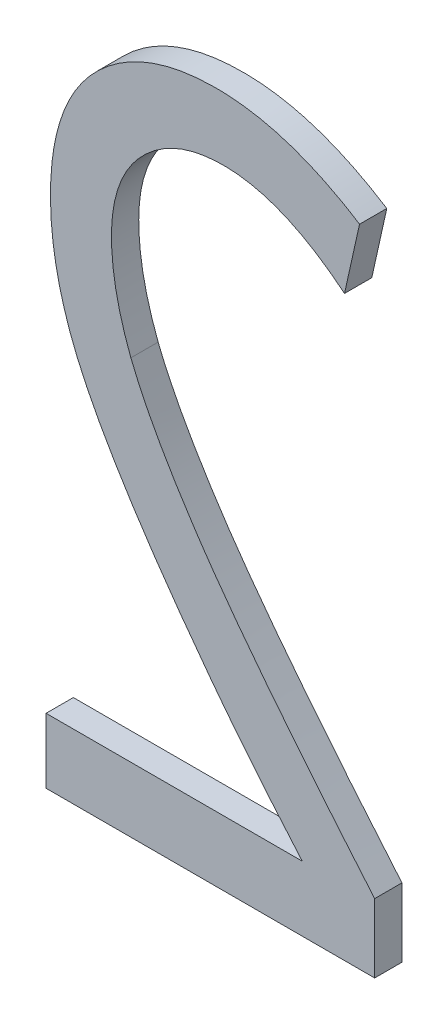
ISO-10303-21;
HEADER;
FILE_DESCRIPTION(('STEP AP214'),'2;1');
FILE_NAME('part.step','',(''),(''),'','','');
FILE_SCHEMA(('AUTOMOTIVE_DESIGN { 1 0 10303 214 1 1 1 1 }'));
ENDSEC;
DATA;
#1=APPLICATION_CONTEXT('core data for automotive mechanical design processes');
#2=APPLICATION_PROTOCOL_DEFINITION('international standard','automotive_design',2000,#1);
#3=PRODUCT_CONTEXT('',#1,'mechanical');
#4=PRODUCT('Part','Part','',(#3));
#5=PRODUCT_RELATED_PRODUCT_CATEGORY('part','',(#4));
#6=PRODUCT_DEFINITION_FORMATION('','',#4);
#7=PRODUCT_DEFINITION_CONTEXT('part definition',#1,'design');
#8=PRODUCT_DEFINITION('design','',#6,#7);
#9=PRODUCT_DEFINITION_SHAPE('','',#8);
#10=(LENGTH_UNIT() NAMED_UNIT(*) SI_UNIT(.MILLI.,.METRE.));
#11=(NAMED_UNIT(*) PLANE_ANGLE_UNIT() SI_UNIT($,.RADIAN.));
#12=(NAMED_UNIT(*) SI_UNIT($,.STERADIAN.) SOLID_ANGLE_UNIT());
#13=UNCERTAINTY_MEASURE_WITH_UNIT(LENGTH_MEASURE(1.E-05),#10,'distance_accuracy_value','');
#14=(GEOMETRIC_REPRESENTATION_CONTEXT(3) GLOBAL_UNCERTAINTY_ASSIGNED_CONTEXT((#13)) GLOBAL_UNIT_ASSIGNED_CONTEXT((#10,
#11,#12)) REPRESENTATION_CONTEXT('',''));
#15=CARTESIAN_POINT('',(0.,0.,0.));
#16=DIRECTION('',(0.,0.,1.));
#17=DIRECTION('',(1.,0.,0.));
#18=AXIS2_PLACEMENT_3D('',#15,#16,#17);
#19=CARTESIAN_POINT('',(176.186462183078,125.948278329335,-39.));
#20=DIRECTION('',(0.,0.,1.));
#21=DIRECTION('',(1.,0.,0.));
#22=AXIS2_PLACEMENT_3D('',#19,#20,#21);
#23=PLANE('',#22);
#24=DIRECTION('',(1.,0.,0.));
#25=VECTOR('',#24,1.);
#26=CARTESIAN_POINT('',(176.186462183078,125.152214694954,-39.));
#27=LINE('',#26,#25);
#28=CARTESIAN_POINT('',(176.538703030518,125.152214694954,-39.));
#29=VERTEX_POINT('',#28);
#30=CARTESIAN_POINT('',(175.599159928158,125.152214694954,-39.));
#31=VERTEX_POINT('',#30);
#32=EDGE_CURVE('E128',#29,#31,#27,.F.);
#33=ORIENTED_EDGE('',*,*,#32,.T.);
#34=DIRECTION('',(0.,1.,0.));
#35=VECTOR('',#34,1.);
#36=CARTESIAN_POINT('',(175.599159928158,125.948278329335,-39.));
#37=LINE('',#36,#35);
#38=CARTESIAN_POINT('',(175.599159928158,124.913993413852,-39.));
#39=VERTEX_POINT('',#38);
#40=EDGE_CURVE('E108',#31,#39,#37,.F.);
#41=ORIENTED_EDGE('',*,*,#40,.T.);
#42=DIRECTION('',(1.,0.,0.));
#43=VECTOR('',#42,1.);
#44=CARTESIAN_POINT('',(176.186462183078,124.913993413852,-39.));
#45=LINE('',#44,#43);
#46=CARTESIAN_POINT('',(176.80425900679,124.913993413852,-39.));
#47=VERTEX_POINT('',#46);
#48=EDGE_CURVE('E104',#39,#47,#45,.T.);
#49=ORIENTED_EDGE('',*,*,#48,.T.);
#50=DIRECTION('',(0.,1.,0.));
#51=VECTOR('',#50,1.);
#52=CARTESIAN_POINT('',(176.80425900679,124.913993413852,-39.));
#53=LINE('',#52,#51);
#54=CARTESIAN_POINT('',(176.80425900679,125.166110936351,-39.));
#55=VERTEX_POINT('',#54);
#56=EDGE_CURVE('E102',#55,#47,#53,.F.);
#57=ORIENTED_EDGE('',*,*,#56,.F.);
#58=CARTESIAN_POINT('',(175.910153238773,126.436624435557,-39.));
#59=CARTESIAN_POINT('',(175.916314288537,126.421132313016,-39.));
#60=CARTESIAN_POINT('',(175.922773583856,126.405762428981,-39.));
#61=CARTESIAN_POINT('',(175.936201752756,126.375247302634,-39.));
#62=CARTESIAN_POINT('',(175.943170600172,126.360102048836,-39.));
#63=CARTESIAN_POINT('',(175.957531371676,126.3300152623,-39.));
#64=CARTESIAN_POINT('',(175.964923281686,126.315073722804,-39.));
#65=CARTESIAN_POINT('',(175.980069878448,126.285376729993,-39.));
#66=CARTESIAN_POINT('',(175.987824557065,126.270621272514,-39.));
#67=CARTESIAN_POINT('',(176.01155977025,126.226603293513,-39.));
#68=CARTESIAN_POINT('',(176.028009625772,126.197592989437,-39.));
#69=CARTESIAN_POINT('',(176.05340589262,126.154512475279,-39.));
#70=CARTESIAN_POINT('',(176.061990835528,126.140225937032,-39.));
#71=CARTESIAN_POINT('',(176.088073130404,126.097562698147,-39.));
#72=CARTESIAN_POINT('',(176.105896806171,126.069384376933,-39.));
#73=CARTESIAN_POINT('',(176.133151976455,126.027460170251,-39.));
#74=CARTESIAN_POINT('',(176.142323247732,126.013543222797,-39.));
#75=CARTESIAN_POINT('',(176.170095567593,125.971961757683,-39.));
#76=CARTESIAN_POINT('',(176.188954099897,125.944468232993,-39.));
#77=CARTESIAN_POINT('',(176.227305520416,125.889930433792,-39.));
#78=CARTESIAN_POINT('',(176.246798392881,125.862886148153,-39.));
#79=CARTESIAN_POINT('',(176.286222888752,125.809121395734,-39.));
#80=CARTESIAN_POINT('',(176.306154502844,125.782400922097,-39.));
#81=CARTESIAN_POINT('',(176.346370982392,125.729228009605,-39.));
#82=CARTESIAN_POINT('',(176.366655843966,125.70277556781,-39.));
#83=CARTESIAN_POINT('',(176.407508617747,125.650090768106,-39.));
#84=CARTESIAN_POINT('',(176.428076528186,125.623858408825,-39.));
#85=CARTESIAN_POINT('',(176.469448333987,125.571580851571,-39.));
#86=CARTESIAN_POINT('',(176.490252228451,125.545535652887,-39.));
#87=CARTESIAN_POINT('',(176.552962459234,125.467638921907,-39.));
#88=CARTESIAN_POINT('',(176.595166709886,125.416027066146,-39.));
#89=CARTESIAN_POINT('',(176.6589181631,125.338980235817,-39.));
#90=CARTESIAN_POINT('',(176.680242604162,125.31336004769,-39.));
#91=CARTESIAN_POINT('',(176.735684020125,125.247101268435,-39.));
#92=CARTESIAN_POINT('',(176.769902964442,125.206547984025,-39.));
#93=CARTESIAN_POINT('',(176.80425900679,125.166110936351,-39.));
#94=B_SPLINE_CURVE_WITH_KNOTS('',3,(#58,#59,#60,#61,#62,#63,#64,#65,#66,#67,#68,#69,#70,#71,#72,
#73,#74,#75,#76,#77,#78,#79,#80,#81,#82,#83,#84,#85,#86,#87,#88,#89,#90,#91,#92,#93),
.UNSPECIFIED.,.F.,.F.,(4,2,2,2,2,2,2,2,2,2,2,2,2,2,2,2,2,4),(0.,0.0500087757286879,
0.100014985312796,0.15001953180802,0.200022957623737,0.300042550380288,0.350044224300969,
0.450054488447357,0.500055433134777,0.600063057039021,0.700068199814345,0.800071221646806,
0.900073145683822,1.00007444573211,1.10007536526149,1.30008029152963,1.40008068587397,
1.55926333786802),.UNSPECIFIED.);
#95=CARTESIAN_POINT('',(175.910153238773,126.436624435557,-39.));
#96=VERTEX_POINT('',#95);
#97=EDGE_CURVE('E24',#96,#55,#94,.T.);
#98=ORIENTED_EDGE('',*,*,#97,.F.);
#99=CARTESIAN_POINT('',(176.693694826555,127.032839364091,-39.));
#100=CARTESIAN_POINT('',(176.667890074658,127.053892125233,-39.));
#101=CARTESIAN_POINT('',(176.641204172883,127.074000949937,-39.));
#102=CARTESIAN_POINT('',(176.58565848333,127.111647626545,-39.));
#103=CARTESIAN_POINT('',(176.556777870025,127.129154494778,-39.));
#104=CARTESIAN_POINT('',(176.496846345355,127.16048662411,-39.));
#105=CARTESIAN_POINT('',(176.465785130981,127.17429268314,-39.));
#106=CARTESIAN_POINT('',(176.401919028892,127.196769154013,-39.));
#107=CARTESIAN_POINT('',(176.369122129279,127.205461184089,-39.));
#108=CARTESIAN_POINT('',(176.32244801561,127.213244571093,-39.));
#109=CARTESIAN_POINT('',(176.308986221254,127.214968783175,-39.));
#110=CARTESIAN_POINT('',(176.281963074258,127.217341189161,-39.));
#111=CARTESIAN_POINT('',(176.268401706681,127.217989218195,-39.));
#112=CARTESIAN_POINT('',(176.241262774364,127.218225631912,-39.));
#113=CARTESIAN_POINT('',(176.227685204816,127.217813431986,-39.));
#114=CARTESIAN_POINT('',(176.200610042577,127.215908870563,-39.));
#115=CARTESIAN_POINT('',(176.187112432014,127.214416760413,-39.));
#116=CARTESIAN_POINT('',(176.151818383751,127.208876445988,-39.));
#117=CARTESIAN_POINT('',(176.130166186019,127.203808940999,-39.));
#118=CARTESIAN_POINT('',(176.088058999034,127.190100637508,-39.));
#119=CARTESIAN_POINT('',(176.067601705668,127.181466993905,-39.));
#120=CARTESIAN_POINT('',(176.028495595677,127.160663213691,-39.));
#121=CARTESIAN_POINT('',(176.009850910823,127.148485238908,-39.));
#122=CARTESIAN_POINT('',(175.983670521943,127.127964627676,-39.));
#123=CARTESIAN_POINT('',(175.975231364355,127.120737580784,-39.));
#124=CARTESIAN_POINT('',(175.95894869125,127.105636316063,-39.));
#125=CARTESIAN_POINT('',(175.951105224365,127.097762045503,-39.));
#126=CARTESIAN_POINT('',(175.936120078777,127.081401713745,-39.));
#127=CARTESIAN_POINT('',(175.928976823645,127.072917105028,-39.));
#128=CARTESIAN_POINT('',(175.915500689425,127.055332912897,-39.));
#129=CARTESIAN_POINT('',(175.909167560505,127.046233520403,-39.));
#130=CARTESIAN_POINT('',(175.89147098491,127.018179588419,-39.));
#131=CARTESIAN_POINT('',(175.881362082298,126.998416641936,-39.));
#132=CARTESIAN_POINT('',(175.863262418195,126.954227978386,-39.));
#133=CARTESIAN_POINT('',(175.85587014431,126.929562397221,-39.));
#134=CARTESIAN_POINT('',(175.845151021304,126.879305951645,-39.));
#135=CARTESIAN_POINT('',(175.841840710998,126.853711752755,-39.));
#136=CARTESIAN_POINT('',(175.838854039364,126.806551172577,-39.));
#137=CARTESIAN_POINT('',(175.838672351285,126.785009869475,-39.));
#138=CARTESIAN_POINT('',(175.840035148776,126.741972564923,-39.));
#139=CARTESIAN_POINT('',(175.841581044824,126.720476614867,-39.));
#140=CARTESIAN_POINT('',(175.846287160083,126.677627307793,-39.));
#141=CARTESIAN_POINT('',(175.849450101943,126.656274252999,-39.));
#142=CARTESIAN_POINT('',(175.857218525628,126.613847555168,-39.));
#143=CARTESIAN_POINT('',(175.861823261039,126.592773773423,-39.));
#144=CARTESIAN_POINT('',(175.872850443304,126.548827276364,-39.));
#145=CARTESIAN_POINT('',(175.879410031041,126.525989308048,-39.));
#146=CARTESIAN_POINT('',(175.893844505575,126.480899623099,-39.));
#147=CARTESIAN_POINT('',(175.901710294248,126.458645005543,-39.));
#148=CARTESIAN_POINT('',(175.910153238773,126.436624435557,-39.));
#149=B_SPLINE_CURVE_WITH_KNOTS('',3,(#99,#100,#101,#102,#103,#104,#105,#106,#107,#108,#109,#110,
#111,#112,#113,#114,#115,#116,#117,#118,#119,#120,#121,#122,#123,#124,#125,#126,#127,#128,#129,
#130,#131,#132,#133,#134,#135,#136,#137,#138,#139,#140,#141,#142,#143,#144,#145,#146,#147,#148),
.UNSPECIFIED.,.F.,.F.,(4,2,2,2,2,2,2,2,2,2,2,2,2,2,2,2,2,2,2,2,2,2,2,2,4),(0.,0.100017091060518,
0.201143319787843,0.302784519930571,0.403992912424018,0.444673257895493,0.485359834993983,
0.526068851491846,0.566768396115531,0.633179965507584,0.699458932731975,0.76588560212782,
0.799188569711173,0.832494253265738,0.865723143215218,0.898941760980865,0.965167907700336,
1.04200009692954,1.11914257357634,1.1836822873529,1.24827473282225,1.31297629365965,
1.37764441378402,1.44888237926519,1.51964349919607),.UNSPECIFIED.);
#150=CARTESIAN_POINT('',(176.693694826555,127.032839364091,-39.));
#151=VERTEX_POINT('',#150);
#152=EDGE_CURVE('E89',#151,#96,#149,.T.);
#153=ORIENTED_EDGE('',*,*,#152,.F.);
#154=DIRECTION('',(0.217054100601057,0.976159575792947,0.));
#155=VECTOR('',#154,1.);
#156=CARTESIAN_POINT('',(176.693694826555,127.032839364091,-39.));
#157=LINE('',#156,#155);
#158=CARTESIAN_POINT('',(176.748724487038,127.280324806124,-39.));
#159=VERTEX_POINT('',#158);
#160=EDGE_CURVE('E125',#159,#151,#157,.F.);
#161=ORIENTED_EDGE('',*,*,#160,.F.);
#162=CARTESIAN_POINT('',(176.538703030518,125.152214694954,-39.));
#163=CARTESIAN_POINT('',(176.516823193256,125.177352437158,-39.));
#164=CARTESIAN_POINT('',(176.495069673509,125.202599393354,-39.));
#165=CARTESIAN_POINT('',(176.451828996767,125.253346808572,-39.));
#166=CARTESIAN_POINT('',(176.430342009775,125.278847412402,-39.));
#167=CARTESIAN_POINT('',(176.366257334359,125.355837055005,-39.));
#168=CARTESIAN_POINT('',(176.324122205599,125.407715208436,-39.));
#169=CARTESIAN_POINT('',(176.24153286093,125.512802634338,-39.));
#170=CARTESIAN_POINT('',(176.20107890225,125.566012108527,-39.));
#171=CARTESIAN_POINT('',(176.121391786666,125.673272051005,-39.));
#172=CARTESIAN_POINT('',(176.08215773043,125.727321853466,-39.));
#173=CARTESIAN_POINT('',(176.005357188513,125.836590482849,-39.));
#174=CARTESIAN_POINT('',(175.967790418349,125.891809107946,-39.));
#175=CARTESIAN_POINT('',(175.905438250807,125.987709087949,-39.));
#176=CARTESIAN_POINT('',(175.880078736669,126.02801472736,-39.));
#177=CARTESIAN_POINT('',(175.843251929329,126.089258759104,-39.));
#178=CARTESIAN_POINT('',(175.831166839112,126.109825488198,-39.));
#179=CARTESIAN_POINT('',(175.807491903833,126.151254066613,-39.));
#180=CARTESIAN_POINT('',(175.795902254936,126.172116028556,-39.));
#181=CARTESIAN_POINT('',(175.774290417139,126.212411939061,-39.));
#182=CARTESIAN_POINT('',(175.764218268992,126.2318190186,-39.));
#183=CARTESIAN_POINT('',(175.744712567438,126.270952836367,-39.));
#184=CARTESIAN_POINT('',(175.735278987782,126.290679561413,-39.));
#185=CARTESIAN_POINT('',(175.717289980596,126.330528332224,-39.));
#186=CARTESIAN_POINT('',(175.708734358951,126.350650289425,-39.));
#187=CARTESIAN_POINT('',(175.692639876808,126.391295204578,-39.));
#188=CARTESIAN_POINT('',(175.685101021988,126.411818164769,-39.));
#189=CARTESIAN_POINT('',(175.664129463157,126.473796303652,-39.));
#190=CARTESIAN_POINT('',(175.652276865338,126.515802675121,-39.));
#191=CARTESIAN_POINT('',(175.633305636271,126.600863530483,-39.));
#192=CARTESIAN_POINT('',(175.626185521249,126.643917681475,-39.));
#193=CARTESIAN_POINT('',(175.616662444173,126.733481552713,-39.));
#194=CARTESIAN_POINT('',(175.614610223788,126.78002840288,-39.));
#195=CARTESIAN_POINT('',(175.616429839409,126.87310226004,-39.));
#196=CARTESIAN_POINT('',(175.620304804156,126.919629243576,-39.));
#197=CARTESIAN_POINT('',(175.634028364101,126.99909519334,-39.));
#198=CARTESIAN_POINT('',(175.642002734946,127.032341061517,-39.));
#199=CARTESIAN_POINT('',(175.663120550097,127.097086364679,-39.));
#200=CARTESIAN_POINT('',(175.676247146821,127.128591113819,-39.));
#201=CARTESIAN_POINT('',(175.708375172988,127.188983979122,-39.));
#202=CARTESIAN_POINT('',(175.727439941304,127.217839319992,-39.));
#203=CARTESIAN_POINT('',(175.760086120777,127.25779232083,-39.));
#204=CARTESIAN_POINT('',(175.771661424293,127.270570001373,-39.));
#205=CARTESIAN_POINT('',(175.796026049451,127.294911409495,-39.));
#206=CARTESIAN_POINT('',(175.80881560341,127.306474903873,-39.));
#207=CARTESIAN_POINT('',(175.844898234257,127.336203641336,-39.));
#208=CARTESIAN_POINT('',(175.869176379354,127.353194685371,-39.));
#209=CARTESIAN_POINT('',(175.920171582803,127.382992521342,-39.));
#210=CARTESIAN_POINT('',(175.946888065679,127.39580029733,-39.));
#211=CARTESIAN_POINT('',(175.988856200814,127.412072707861,-39.));
#212=CARTESIAN_POINT('',(176.00353080592,127.417086607055,-39.));
#213=CARTESIAN_POINT('',(176.033211114956,127.425971632875,-39.));
#214=CARTESIAN_POINT('',(176.048216540955,127.429843682218,-39.));
#215=CARTESIAN_POINT('',(176.078484902017,127.436506777138,-39.));
#216=CARTESIAN_POINT('',(176.093748168334,127.439296300942,-39.));
#217=CARTESIAN_POINT('',(176.124430980495,127.443853768477,-39.));
#218=CARTESIAN_POINT('',(176.139850596504,127.445621230833,-39.));
#219=CARTESIAN_POINT('',(176.178201836755,127.448853705655,-39.));
#220=CARTESIAN_POINT('',(176.201181214174,127.449764858281,-39.));
#221=CARTESIAN_POINT('',(176.2471329331,127.449688055442,-39.));
#222=CARTESIAN_POINT('',(176.270105273568,127.448699893226,-39.));
#223=CARTESIAN_POINT('',(176.338886742421,127.442778122788,-39.));
#224=CARTESIAN_POINT('',(176.384463729371,127.434879051073,-39.));
#225=CARTESIAN_POINT('',(176.486164074012,127.409022693598,-39.));
#226=CARTESIAN_POINT('',(176.541723376264,127.388889899009,-39.));
#227=CARTESIAN_POINT('',(176.621838010731,127.352364040463,-39.));
#228=CARTESIAN_POINT('',(176.647944881086,127.339174678222,-39.));
#229=CARTESIAN_POINT('',(176.699101969402,127.311014787855,-39.));
#230=CARTESIAN_POINT('',(176.724154565099,127.296048594945,-39.));
#231=CARTESIAN_POINT('',(176.748724487038,127.280324806124,-39.));
#232=B_SPLINE_CURVE_WITH_KNOTS('',3,(#162,#163,#164,#165,#166,#167,#168,#169,#170,#171,#172,
#173,#174,#175,#176,#177,#178,#179,#180,#181,#182,#183,#184,#185,#186,#187,#188,#189,#190,#191,
#192,#193,#194,#195,#196,#197,#198,#199,#200,#201,#202,#203,#204,#205,#206,#207,#208,#209,#210,
#211,#212,#213,#214,#215,#216,#217,#218,#219,#220,#221,#222,#223,#224,#225,#226,#227,#228,#229,
#230,#231),.UNSPECIFIED.,.F.,.F.,(4,2,2,2,2,2,2,2,2,2,2,2,2,2,2,2,2,2,2,2,2,2,2,2,2,2,2,2,2,2,2,
2,2,2,4),(0.,0.0999767718294488,0.20001433383295,0.40048269436516,0.60098161567559,
0.801329041651492,1.00164215072502,1.14446996126355,1.21602823502691,1.28761458405401,
1.35320079741021,1.41878431310205,1.48435329691085,1.54992264675593,1.68059526903046,
1.81122690217317,1.95067370479258,2.09019414161789,2.19241019688083,2.29429475748318,
2.3973055942525,2.44895088202824,2.50060607088349,2.58910563433466,2.677584364564,
2.72406792285437,2.77051381463337,2.81702476375599,2.86355760104066,2.93246017383151,
3.00137024746933,3.1394772454936,3.31572993405236,3.40342355584584,3.49090745239207),.UNSPECIFIED.);
#233=EDGE_CURVE('E173',#29,#159,#232,.T.);
#234=ORIENTED_EDGE('',*,*,#233,.F.);
#235=EDGE_LOOP('',(#33,#41,#49,#57,#98,#153,#161,#234));
#236=FACE_BOUND('',#235,.T.);
#237=ADVANCED_FACE('F17',(#236),#23,.T.);
#238=CARTESIAN_POINT('',(176.80425900679,124.913993413852,-39.1));
#239=DIRECTION('',(1.,0.,0.));
#240=DIRECTION('',(0.,0.,-1.));
#241=AXIS2_PLACEMENT_3D('',#238,#239,#240);
#242=PLANE('',#241);
#243=DIRECTION('',(0.,1.,0.));
#244=VECTOR('',#243,1.);
#245=CARTESIAN_POINT('',(176.80425900679,125.948278329335,-39.1));
#246=LINE('',#245,#244);
#247=CARTESIAN_POINT('',(176.80425900679,124.913993413852,-39.1));
#248=VERTEX_POINT('',#247);
#249=CARTESIAN_POINT('',(176.80425900679,125.166110936351,-39.1));
#250=VERTEX_POINT('',#249);
#251=EDGE_CURVE('E112',#248,#250,#246,.T.);
#252=ORIENTED_EDGE('',*,*,#251,.T.);
#253=DIRECTION('',(0.,0.,-1.));
#254=VECTOR('',#253,1.);
#255=CARTESIAN_POINT('',(176.80425900679,125.166110936351,-39.05));
#256=LINE('',#255,#254);
#257=EDGE_CURVE('E98',#55,#250,#256,.T.);
#258=ORIENTED_EDGE('',*,*,#257,.F.);
#259=ORIENTED_EDGE('',*,*,#56,.T.);
#260=DIRECTION('',(0.,0.,-1.));
#261=VECTOR('',#260,1.);
#262=CARTESIAN_POINT('',(176.80425900679,124.913993413852,-39.1));
#263=LINE('',#262,#261);
#264=EDGE_CURVE('E117',#248,#47,#263,.F.);
#265=ORIENTED_EDGE('',*,*,#264,.F.);
#266=EDGE_LOOP('',(#252,#258,#259,#265));
#267=FACE_BOUND('',#266,.T.);
#268=ADVANCED_FACE('F111',(#267),#242,.T.);
#269=CARTESIAN_POINT('',(176.80425900679,125.166110936351,-39.1));
#270=CARTESIAN_POINT('',(176.80425900679,125.166110936351,-39.));
#271=CARTESIAN_POINT('',(176.512450348454,125.509546616605,-39.1));
#272=CARTESIAN_POINT('',(176.512450348454,125.509546616605,-39.));
#273=CARTESIAN_POINT('',(176.299904595582,125.780192460967,-39.1));
#274=CARTESIAN_POINT('',(176.299904595582,125.780192460967,-39.));
#275=CARTESIAN_POINT('',(176.045510423514,126.15641099938,-39.1));
#276=CARTESIAN_POINT('',(176.045510423514,126.15641099938,-39.));
#277=CARTESIAN_POINT('',(175.960639165821,126.309573085637,-39.1));
#278=CARTESIAN_POINT('',(175.960639165821,126.309573085637,-39.));
#279=CARTESIAN_POINT('',(175.910153238773,126.436624435557,-39.1));
#280=CARTESIAN_POINT('',(175.910153238773,126.436624435557,-39.));
#281=B_SPLINE_SURFACE_WITH_KNOTS('',3,1,((#269,#270),(#271,#272),(#273,#274),(#275,#276),(#277,
#278),(#279,#280)),.UNSPECIFIED.,.F.,.F.,.F.,(4,2,4),(2,2),(0.,0.525907121177191,1.),(1.,1.1),.UNSPECIFIED.);
#282=CARTESIAN_POINT('',(176.80425900679,125.166110936351,-39.1));
#283=CARTESIAN_POINT('',(176.782675981464,125.191513419227,-39.1));
#284=CARTESIAN_POINT('',(176.761147281265,125.216962250277,-39.1));
#285=CARTESIAN_POINT('',(176.718213706342,125.267964156109,-39.1));
#286=CARTESIAN_POINT('',(176.696808831695,125.293517230956,-39.1));
#287=CARTESIAN_POINT('',(176.664805814007,125.331933634558,-39.1));
#288=CARTESIAN_POINT('',(176.654155535516,125.344753553456,-39.1));
#289=CARTESIAN_POINT('',(176.62226016726,125.38325948921,-39.1));
#290=CARTESIAN_POINT('',(176.601070621653,125.408991593318,-39.1));
#291=CARTESIAN_POINT('',(176.56941362243,125.447693752213,-39.1));
#292=CARTESIAN_POINT('',(176.558882525628,125.460611785303,-39.1));
#293=CARTESIAN_POINT('',(176.537866061777,125.486484993364,-39.1));
#294=CARTESIAN_POINT('',(176.527380694738,125.499440168343,-39.1));
#295=CARTESIAN_POINT('',(176.495998182996,125.538365440216,-39.1));
#296=CARTESIAN_POINT('',(176.475174762594,125.564395119262,-39.1));
#297=CARTESIAN_POINT('',(176.444113917551,125.603577551715,-39.1));
#298=CARTESIAN_POINT('',(176.433789377762,125.616661312678,-39.1));
#299=CARTESIAN_POINT('',(176.413203935729,125.64287884194,-39.1));
#300=CARTESIAN_POINT('',(176.402943033516,125.656012610264,-39.1));
#301=CARTESIAN_POINT('',(176.382491203648,125.682334544677,-39.1));
#302=CARTESIAN_POINT('',(176.372300276038,125.695522710801,-39.1));
#303=CARTESIAN_POINT('',(176.351995896369,125.721958591561,-39.1));
#304=CARTESIAN_POINT('',(176.341882444376,125.735206306246,-39.1));
#305=CARTESIAN_POINT('',(176.321741907581,125.761767281336,-39.1));
#306=CARTESIAN_POINT('',(176.311714822875,125.775080541813,-39.1));
#307=CARTESIAN_POINT('',(176.291757806607,125.801779752349,-39.1));
#308=CARTESIAN_POINT('',(176.281827875188,125.815165702517,-39.1));
#309=CARTESIAN_POINT('',(176.262078064756,125.842018656015,-39.1));
#310=CARTESIAN_POINT('',(176.252258185967,125.855485659511,-39.1));
#311=CARTESIAN_POINT('',(176.232745547282,125.882511554603,-39.1));
#312=CARTESIAN_POINT('',(176.223052787753,125.896070446465,-39.1));
#313=CARTESIAN_POINT('',(176.203812104933,125.923290901018,-39.1));
#314=CARTESIAN_POINT('',(176.194264182254,125.936952464142,-39.1));
#315=CARTESIAN_POINT('',(176.175350828046,125.964401450942,-39.1));
#316=CARTESIAN_POINT('',(176.16598539746,125.978188875267,-39.1));
#317=CARTESIAN_POINT('',(176.14741645514,126.005872234078,-39.1));
#318=CARTESIAN_POINT('',(176.138212942725,126.019768168108,-39.1));
#319=CARTESIAN_POINT('',(176.124537038515,126.040696336037,-39.1));
#320=CARTESIAN_POINT('',(176.119999992063,126.047686393177,-39.1));
#321=CARTESIAN_POINT('',(176.106457001408,126.068701001598,-39.1));
#322=CARTESIAN_POINT('',(176.097519367221,126.082769746585,-39.1));
#323=CARTESIAN_POINT('',(176.084264163448,126.103967088467,-39.1));
#324=CARTESIAN_POINT('',(176.079871004481,126.111048516411,-39.1));
#325=CARTESIAN_POINT('',(176.071137898534,126.125244103805,-39.1));
#326=CARTESIAN_POINT('',(176.066797951591,126.132358263278,-39.1));
#327=CARTESIAN_POINT('',(176.053861993642,126.153752216135,-39.1));
#328=CARTESIAN_POINT('',(176.045350096379,126.168083115382,-39.1));
#329=CARTESIAN_POINT('',(176.032771807609,126.1896892849,-39.1));
#330=CARTESIAN_POINT('',(176.028610685044,126.196909559856,-39.1));
#331=CARTESIAN_POINT('',(176.020355593264,126.211388474837,-39.1));
#332=CARTESIAN_POINT('',(176.01626162413,126.218647114908,-39.1));
#333=CARTESIAN_POINT('',(176.008145368728,126.233204308702,-39.1));
#334=CARTESIAN_POINT('',(176.00412308256,126.240502862481,-39.1));
#335=CARTESIAN_POINT('',(175.992170381668,126.262462016431,-39.1));
#336=CARTESIAN_POINT('',(175.984354514512,126.277185427135,-39.1));
#337=CARTESIAN_POINT('',(175.972895755207,126.299406347226,-39.1));
#338=CARTESIAN_POINT('',(175.969120417223,126.306835800485,-39.1));
#339=CARTESIAN_POINT('',(175.961665050022,126.321742488232,-39.1));
#340=CARTESIAN_POINT('',(175.957985021076,126.329219722856,-39.1));
#341=CARTESIAN_POINT('',(175.950728164034,126.34422416894,-39.1));
#342=CARTESIAN_POINT('',(175.947151336296,126.351751380574,-39.1));
#343=CARTESIAN_POINT('',(175.94010993047,126.366858212728,-39.1));
#344=CARTESIAN_POINT('',(175.936645352858,126.37443783347,-39.1));
#345=CARTESIAN_POINT('',(175.929838617987,126.389651983016,-39.1));
#346=CARTESIAN_POINT('',(175.926496461367,126.397286512107,-39.1));
#347=CARTESIAN_POINT('',(175.918733588919,126.415452749111,-39.1));
#348=CARTESIAN_POINT('',(175.914372098692,126.426009763201,-39.1));
#349=CARTESIAN_POINT('',(175.910153238773,126.436624435557,-39.1));
#350=B_SPLINE_CURVE_WITH_KNOTS('',3,(#282,#283,#284,#285,#286,#287,#288,#289,#290,#291,#292,
#293,#294,#295,#296,#297,#298,#299,#300,#301,#302,#303,#304,#305,#306,#307,#308,#309,#310,#311,
#312,#313,#314,#315,#316,#317,#318,#319,#320,#321,#322,#323,#324,#325,#326,#327,#328,#329,#330,
#331,#332,#333,#334,#335,#336,#337,#338,#339,#340,#341,#342,#343,#344,#345,#346,#347,#348,#349),
.UNSPECIFIED.,.F.,.F.,(4,2,2,2,2,2,2,2,2,2,2,2,2,2,2,2,2,2,2,2,2,2,2,2,2,2,2,2,2,2,2,2,2,4),(0.,
0.100000254559602,0.20000057150244,0.250000619652475,0.350001075308052,0.400001146390069,
0.450001228333165,0.550002031145756,0.600002162630437,0.650002319417866,0.700002508458128,
0.750002739259425,0.800003025103918,0.85000338499375,0.90000384687211,0.950004453168657,
1.00000527079363,1.05000634658731,1.10000721193615,1.12500733661947,1.17500846167313,
1.20000862614633,1.22500880769711,1.27501047539738,1.30001072513174,1.32501100520887,
1.35001132079574,1.40001430863975,1.42501477479512,1.45001531215103,1.47501593588351,
1.5000166653469,1.52501752549395,1.55928215406863),.UNSPECIFIED.);
#351=CARTESIAN_POINT('',(175.910153238773,126.436624435557,-39.1));
#352=VERTEX_POINT('',#351);
#353=EDGE_CURVE('E167',#250,#352,#350,.T.);
#354=DIRECTION('',(0.,0.,-1.));
#355=VECTOR('',#354,1.);
#356=CARTESIAN_POINT('',(175.910153238773,126.436624435557,-39.05));
#357=LINE('',#356,#355);
#358=EDGE_CURVE('E100',#96,#352,#357,.T.);
#359=ORIENTED_EDGE('',*,*,#353,.T.);
#360=ORIENTED_EDGE('',*,*,#358,.F.);
#361=ORIENTED_EDGE('',*,*,#97,.T.);
#362=ORIENTED_EDGE('',*,*,#257,.T.);
#363=EDGE_LOOP('',(#359,#360,#361,#362));
#364=FACE_BOUND('',#363,.T.);
#365=ADVANCED_FACE('F96',(#364),#281,.T.);
#366=CARTESIAN_POINT('',(175.910153238773,126.436624435557,-39.1));
#367=CARTESIAN_POINT('',(175.910153238773,126.436624435557,-39.));
#368=CARTESIAN_POINT('',(175.862696467348,126.560367156574,-39.1));
#369=CARTESIAN_POINT('',(175.862696467348,126.560367156574,-39.));
#370=CARTESIAN_POINT('',(175.838968081636,126.677492619782,-39.1));
#371=CARTESIAN_POINT('',(175.838968081636,126.677492619782,-39.));
#372=CARTESIAN_POINT('',(175.838968081636,126.91372872354,-39.1));
#373=CARTESIAN_POINT('',(175.838968081636,126.91372872354,-39.));
#374=CARTESIAN_POINT('',(175.874308230569,127.014972768008,-39.1));
#375=CARTESIAN_POINT('',(175.874308230569,127.014972768008,-39.));
#376=CARTESIAN_POINT('',(176.023465893981,127.175564468112,-39.1));
#377=CARTESIAN_POINT('',(176.023465893981,127.175564468112,-39.));
#378=CARTESIAN_POINT('',(176.125223287997,127.218122582725,-39.1));
#379=CARTESIAN_POINT('',(176.125223287997,127.218122582725,-39.));
#380=CARTESIAN_POINT('',(176.394313279162,127.218122582725,-39.1));
#381=CARTESIAN_POINT('',(176.394313279162,127.218122582725,-39.));
#382=CARTESIAN_POINT('',(176.542237045412,127.156582085107,-39.1));
#383=CARTESIAN_POINT('',(176.542237045412,127.156582085107,-39.));
#384=CARTESIAN_POINT('',(176.693694826555,127.032839364091,-39.1));
#385=CARTESIAN_POINT('',(176.693694826555,127.032839364091,-39.));
#386=B_SPLINE_SURFACE_WITH_KNOTS('',3,1,((#366,#367),(#368,#369),(#370,#371),(#372,#373),(#374,
#375),(#376,#377),(#378,#379),(#380,#381),(#382,#383),(#384,#385)),.UNSPECIFIED.,.F.,.F.,.F.,(4,
2,2,2,4),(2,2),(0.,0.206536823199473,0.44151883761803,0.702422795278672,1.),(1.,1.1),.UNSPECIFIED.);
#387=CARTESIAN_POINT('',(175.910153238773,126.436624435557,-39.1));
#388=CARTESIAN_POINT('',(175.898292950708,126.467591222721,-39.1));
#389=CARTESIAN_POINT('',(175.887554703026,126.499022059179,-39.1));
#390=CARTESIAN_POINT('',(175.868713160722,126.563315623003,-39.1));
#391=CARTESIAN_POINT('',(175.860664724906,126.596194278501,-39.1));
#392=CARTESIAN_POINT('',(175.846049895341,126.673515447798,-39.1));
#393=CARTESIAN_POINT('',(175.840820830945,126.718235286101,-39.1));
#394=CARTESIAN_POINT('',(175.838645300768,126.785328941896,-39.1));
#395=CARTESIAN_POINT('',(175.838854776825,126.807621450309,-39.1));
#396=CARTESIAN_POINT('',(175.841807529596,126.852025149074,-39.1));
#397=CARTESIAN_POINT('',(175.844545945602,126.874136605188,-39.1));
#398=CARTESIAN_POINT('',(175.853066638301,126.917993665187,-39.1));
#399=CARTESIAN_POINT('',(175.858876140384,126.939734171986,-39.1));
#400=CARTESIAN_POINT('',(175.873983218492,126.981970999731,-39.1));
#401=CARTESIAN_POINT('',(175.883274568399,127.002469466093,-39.1));
#402=CARTESIAN_POINT('',(175.899879998627,127.031740122677,-39.1));
#403=CARTESIAN_POINT('',(175.905879992594,127.041274889768,-39.1));
#404=CARTESIAN_POINT('',(175.918731358269,127.059757940471,-39.1));
#405=CARTESIAN_POINT('',(175.92558279208,127.06870618123,-39.1));
#406=CARTESIAN_POINT('',(175.940092325534,127.085949643972,-39.1));
#407=CARTESIAN_POINT('',(175.947752080383,127.094243462767,-39.1));
#408=CARTESIAN_POINT('',(175.963699128826,127.110204842734,-39.1));
#409=CARTESIAN_POINT('',(175.971986528142,127.117872297946,-39.1));
#410=CARTESIAN_POINT('',(175.988853238808,127.132185412859,-39.1));
#411=CARTESIAN_POINT('',(175.997408433875,127.138859317341,-39.1));
#412=CARTESIAN_POINT('',(176.015050383672,127.151452402684,-39.1));
#413=CARTESIAN_POINT('',(176.024136966571,127.157371825569,-39.1));
#414=CARTESIAN_POINT('',(176.052076826852,127.173875472533,-39.1));
#415=CARTESIAN_POINT('',(176.071664054796,127.183251097187,-39.1));
#416=CARTESIAN_POINT('',(176.111778075044,127.198425612609,-39.1));
#417=CARTESIAN_POINT('',(176.132283646548,127.204281757979,-39.1));
#418=CARTESIAN_POINT('',(176.173962604527,127.212877323089,-39.1));
#419=CARTESIAN_POINT('',(176.195137556456,127.215608780202,-39.1));
#420=CARTESIAN_POINT('',(176.2458612912,127.218959946058,-39.1));
#421=CARTESIAN_POINT('',(176.275494924228,127.218361539624,-39.1));
#422=CARTESIAN_POINT('',(176.334189548858,127.212126425146,-39.1));
#423=CARTESIAN_POINT('',(176.363250766945,127.206491752449,-39.1));
#424=CARTESIAN_POINT('',(176.429631953722,127.18835298036,-39.1));
#425=CARTESIAN_POINT('',(176.466489346949,127.174188957104,-39.1));
#426=CARTESIAN_POINT('',(176.537575938848,127.140245987467,-39.1));
#427=CARTESIAN_POINT('',(176.571794983044,127.120446601187,-39.1));
#428=CARTESIAN_POINT('',(176.620124824145,127.088461534642,-39.1));
#429=CARTESIAN_POINT('',(176.63528203931,127.07780126417,-39.1));
#430=CARTESIAN_POINT('',(176.664939892734,127.055807784361,-39.1));
#431=CARTESIAN_POINT('',(176.679444332243,127.04447971211,-39.1));
#432=CARTESIAN_POINT('',(176.693694826555,127.032839364091,-39.1));
#433=B_SPLINE_CURVE_WITH_KNOTS('',3,(#387,#388,#389,#390,#391,#392,#393,#394,#395,#396,#397,
#398,#399,#400,#401,#402,#403,#404,#405,#406,#407,#408,#409,#410,#411,#412,#413,#414,#415,#416,
#417,#418,#419,#420,#421,#422,#423,#424,#425,#426,#427,#428,#429,#430,#431,#432),.UNSPECIFIED.,
.F.,.F.,(4,2,2,2,2,2,2,2,2,2,2,2,2,2,2,2,2,2,2,2,2,2,4),(0.,0.0994993194010327,
0.200919116723412,0.33538410263356,0.402172627954814,0.468833049997089,0.536094583494465,
0.60323641177214,0.636992639629307,0.670751331079967,0.704580543597287,0.738415467131443,
0.770926269763768,0.803426617122732,0.868217703169997,0.931924039780765,0.995792359765241,
1.0842533440518,1.17267859404232,1.29047093347902,1.40869608177994,1.46427050942085,
1.51946240400369),.UNSPECIFIED.);
#434=CARTESIAN_POINT('',(176.693694826555,127.032839364091,-39.1));
#435=VERTEX_POINT('',#434);
#436=EDGE_CURVE('E152',#352,#435,#433,.T.);
#437=DIRECTION('',(0.,0.,1.));
#438=VECTOR('',#437,1.);
#439=CARTESIAN_POINT('',(176.693694826555,127.032839364091,-39.1));
#440=LINE('',#439,#438);
#441=EDGE_CURVE('E127',#151,#435,#440,.F.);
#442=ORIENTED_EDGE('',*,*,#436,.T.);
#443=ORIENTED_EDGE('',*,*,#441,.F.);
#444=ORIENTED_EDGE('',*,*,#152,.T.);
#445=ORIENTED_EDGE('',*,*,#358,.T.);
#446=EDGE_LOOP('',(#442,#443,#444,#445));
#447=FACE_BOUND('',#446,.T.);
#448=ADVANCED_FACE('F182',(#447),#386,.T.);
#449=CARTESIAN_POINT('',(176.693694826555,127.032839364091,-39.1));
#450=DIRECTION('',(0.976159575792947,-0.217054100601057,0.));
#451=DIRECTION('',(0.217054100601057,0.976159575792947,0.));
#452=AXIS2_PLACEMENT_3D('',#449,#450,#451);
#453=PLANE('',#452);
#454=DIRECTION('',(0.217054100600976,0.976159575792965,0.));
#455=VECTOR('',#454,1.);
#456=CARTESIAN_POINT('',(176.693694826555,127.032839364091,-39.1));
#457=LINE('',#456,#455);
#458=CARTESIAN_POINT('',(176.748724487038,127.280324806124,-39.1));
#459=VERTEX_POINT('',#458);
#460=EDGE_CURVE('E151',#435,#459,#457,.T.);
#461=ORIENTED_EDGE('',*,*,#460,.T.);
#462=DIRECTION('',(0.,0.,-1.));
#463=VECTOR('',#462,1.);
#464=CARTESIAN_POINT('',(176.748724487038,127.280324806124,-39.05));
#465=LINE('',#464,#463);
#466=EDGE_CURVE('E227',#159,#459,#465,.T.);
#467=ORIENTED_EDGE('',*,*,#466,.F.);
#468=ORIENTED_EDGE('',*,*,#160,.T.);
#469=ORIENTED_EDGE('',*,*,#441,.T.);
#470=EDGE_LOOP('',(#461,#467,#468,#469));
#471=FACE_BOUND('',#470,.T.);
#472=ADVANCED_FACE('F195',(#471),#453,.T.);
#473=CARTESIAN_POINT('',(176.748724487038,127.280324806124,-39.1));
#474=CARTESIAN_POINT('',(176.748724487038,127.280324806124,-39.));
#475=CARTESIAN_POINT('',(176.573033460911,127.392818188866,-39.1));
#476=CARTESIAN_POINT('',(176.573033460911,127.392818188866,-39.));
#477=CARTESIAN_POINT('',(176.397847294055,127.449726606018,-39.1));
#478=CARTESIAN_POINT('',(176.397847294055,127.449726606018,-39.));
#479=CARTESIAN_POINT('',(176.053533271589,127.449726606018,-39.1));
#480=CARTESIAN_POINT('',(176.053533271589,127.449726606018,-39.));
#481=CARTESIAN_POINT('',(175.913182394396,127.400097172455,-39.1));
#482=CARTESIAN_POINT('',(175.913182394396,127.400097172455,-39.));
#483=CARTESIAN_POINT('',(175.678844992316,127.189197519461,-39.1));
#484=CARTESIAN_POINT('',(175.678844992316,127.189197519461,-39.));
#485=CARTESIAN_POINT('',(175.615315424814,127.02423692894,-39.1));
#486=CARTESIAN_POINT('',(175.615315424814,127.02423692894,-39.));
#487=CARTESIAN_POINT('',(175.615315424814,126.641097701835,-39.1));
#488=CARTESIAN_POINT('',(175.615315424814,126.641097701835,-39.));
#489=CARTESIAN_POINT('',(175.651665292288,126.476989708188,-39.1));
#490=CARTESIAN_POINT('',(175.651665292288,126.476989708188,-39.));
#491=CARTESIAN_POINT('',(175.811038582171,126.121581994284,-39.1));
#492=CARTESIAN_POINT('',(175.811038582171,126.121581994284,-39.));
#493=CARTESIAN_POINT('',(175.976289803206,125.86158473201,-39.1));
#494=CARTESIAN_POINT('',(175.976289803206,125.86158473201,-39.));
#495=CARTESIAN_POINT('',(176.318647886816,125.411935642372,-39.1));
#496=CARTESIAN_POINT('',(176.318647886816,125.411935642372,-39.));
#497=CARTESIAN_POINT('',(176.42409997612,125.28389812534,-39.1));
#498=CARTESIAN_POINT('',(176.42409997612,125.28389812534,-39.));
#499=CARTESIAN_POINT('',(176.538703030518,125.152214694954,-39.1));
#500=CARTESIAN_POINT('',(176.538703030518,125.152214694954,-39.));
#501=B_SPLINE_SURFACE_WITH_KNOTS('',3,1,((#473,#474),(#475,#476),(#477,#478),(#479,#480),(#481,
#482),(#483,#484),(#485,#486),(#487,#488),(#489,#490),(#491,#492),(#493,#494),(#495,#496),(#497,
#498),(#499,#500)),.UNSPECIFIED.,.F.,.F.,.F.,(4,2,2,2,2,2,4),(2,2),(0.,0.188736121441833,
0.373095753111103,0.583082061038919,0.740413192054324,0.927985381092943,1.),(1.,1.1),.UNSPECIFIED.);
#502=CARTESIAN_POINT('',(176.748724487038,127.280324806124,-39.1));
#503=CARTESIAN_POINT('',(176.720613352634,127.298313455144,-39.1));
#504=CARTESIAN_POINT('',(176.69186053202,127.315316644728,-39.1));
#505=CARTESIAN_POINT('',(176.632887463196,127.346994768735,-39.1));
#506=CARTESIAN_POINT('',(176.602659573235,127.361655408597,-39.1));
#507=CARTESIAN_POINT('',(176.522791430325,127.395803785477,-39.1));
#508=CARTESIAN_POINT('',(176.472150996592,127.413089401918,-39.1));
#509=CARTESIAN_POINT('',(176.394549861949,127.431992232939,-39.1));
#510=CARTESIAN_POINT('',(176.368414342404,127.437121947579,-39.1));
#511=CARTESIAN_POINT('',(176.315767382272,127.444869105982,-39.1));
#512=CARTESIAN_POINT('',(176.289256056863,127.447487303279,-39.1));
#513=CARTESIAN_POINT('',(176.243165578059,127.449723079654,-39.1));
#514=CARTESIAN_POINT('',(176.22361325848,127.449952435077,-39.1));
#515=CARTESIAN_POINT('',(176.184537336366,127.449055952829,-39.1));
#516=CARTESIAN_POINT('',(176.165013734822,127.447930069436,-39.1));
#517=CARTESIAN_POINT('',(176.126134605024,127.444155711783,-39.1));
#518=CARTESIAN_POINT('',(176.106778881359,127.441509349524,-39.1));
#519=CARTESIAN_POINT('',(176.068377638149,127.434553002054,-39.1));
#520=CARTESIAN_POINT('',(176.04933202727,127.430243516255,-39.1));
#521=CARTESIAN_POINT('',(176.000010340065,127.41657360744,-39.1));
#522=CARTESIAN_POINT('',(175.970114039861,127.405738690337,-39.1));
#523=CARTESIAN_POINT('',(175.927004290659,127.38580919001,-39.1));
#524=CARTESIAN_POINT('',(175.912917373627,127.378548956475,-39.1));
#525=CARTESIAN_POINT('',(175.885419499406,127.362832374121,-39.1));
#526=CARTESIAN_POINT('',(175.872008613983,127.354375898672,-39.1));
#527=CARTESIAN_POINT('',(175.845938622589,127.336303562234,-39.1));
#528=CARTESIAN_POINT('',(175.83328177442,127.326684457232,-39.1));
#529=CARTESIAN_POINT('',(175.808818350922,127.306419172749,-39.1));
#530=CARTESIAN_POINT('',(175.797011725738,127.295773053576,-39.1));
#531=CARTESIAN_POINT('',(175.774433175238,127.273443498695,-39.1));
#532=CARTESIAN_POINT('',(175.763660589293,127.261760734587,-39.1));
#533=CARTESIAN_POINT('',(175.743249868987,127.237450624275,-39.1));
#534=CARTESIAN_POINT('',(175.733611608019,127.224823383746,-39.1));
#535=CARTESIAN_POINT('',(175.707606799814,127.18727599269,-39.1));
#536=CARTESIAN_POINT('',(175.69275290998,127.161287225983,-39.1));
#537=CARTESIAN_POINT('',(175.667345258584,127.107315297824,-39.1));
#538=CARTESIAN_POINT('',(175.656795501618,127.079330307377,-39.1));
#539=CARTESIAN_POINT('',(175.635234720046,127.007779235638,-39.1));
#540=CARTESIAN_POINT('',(175.626676426936,126.963475631324,-39.1));
#541=CARTESIAN_POINT('',(175.618977413958,126.896486105556,-39.1));
#542=CARTESIAN_POINT('',(175.617269501598,126.874015319655,-39.1));
#543=CARTESIAN_POINT('',(175.615321279072,126.829003372612,-39.1));
#544=CARTESIAN_POINT('',(175.615080998963,126.806462210039,-39.1));
#545=CARTESIAN_POINT('',(175.616147575815,126.751604179766,-39.1));
#546=CARTESIAN_POINT('',(175.618172898591,126.719300199258,-39.1));
#547=CARTESIAN_POINT('',(175.625006308446,126.6549836595,-39.1));
#548=CARTESIAN_POINT('',(175.62981494851,126.622971159445,-39.1));
#549=CARTESIAN_POINT('',(175.642066200137,126.559546251918,-39.1));
#550=CARTESIAN_POINT('',(175.649501754285,126.528132471957,-39.1));
#551=CARTESIAN_POINT('',(175.666836802309,126.466003049914,-39.1));
#552=CARTESIAN_POINT('',(175.676735741387,126.435287252332,-39.1));
#553=CARTESIAN_POINT('',(175.697204223469,126.379064403177,-39.1));
#554=CARTESIAN_POINT('',(175.707470234249,126.353445976564,-39.1));
#555=CARTESIAN_POINT('',(175.729507106353,126.302868481102,-39.1));
#556=CARTESIAN_POINT('',(175.741278090696,126.277909466356,-39.1));
#557=CARTESIAN_POINT('',(175.765860102436,126.228465017974,-39.1));
#558=CARTESIAN_POINT('',(175.778672812463,126.203980432925,-39.1));
#559=CARTESIAN_POINT('',(175.805092122808,126.155445546166,-39.1));
#560=CARTESIAN_POINT('',(175.818698720705,126.131395243132,-39.1));
#561=CARTESIAN_POINT('',(175.857468442544,126.064898190082,-39.1));
#562=CARTESIAN_POINT('',(175.883310018235,126.022847794847,-39.1));
#563=CARTESIAN_POINT('',(175.936386526573,125.939634421425,-39.1));
#564=CARTESIAN_POINT('',(175.963621717672,125.898471609873,-39.1));
#565=CARTESIAN_POINT('',(176.019129092192,125.816890051948,-39.1));
#566=CARTESIAN_POINT('',(176.047400635586,125.776470868744,-39.1));
#567=CARTESIAN_POINT('',(176.104774566967,125.696231498974,-39.1));
#568=CARTESIAN_POINT('',(176.133876911008,125.656411280894,-39.1));
#569=CARTESIAN_POINT('',(176.17818594421,125.596859130381,-39.1));
#570=CARTESIAN_POINT('',(176.193141116665,125.576939232279,-39.1));
#571=CARTESIAN_POINT('',(176.223215853601,125.537224268003,-39.1));
#572=CARTESIAN_POINT('',(176.238335414401,125.517429199049,-39.1));
#573=CARTESIAN_POINT('',(176.284069050445,125.458334121902,-39.1));
#574=CARTESIAN_POINT('',(176.315058378614,125.419323835737,-39.1));
#575=CARTESIAN_POINT('',(176.377780145147,125.341979648877,-39.1));
#576=CARTESIAN_POINT('',(176.409511729725,125.303645052183,-39.1));
#577=CARTESIAN_POINT('',(176.473638463981,125.227531481297,-39.1));
#578=CARTESIAN_POINT('',(176.506033643442,125.189752532175,-39.1));
#579=CARTESIAN_POINT('',(176.538703030518,125.152214694954,-39.1));
#580=B_SPLINE_CURVE_WITH_KNOTS('',3,(#502,#503,#504,#505,#506,#507,#508,#509,#510,#511,#512,
#513,#514,#515,#516,#517,#518,#519,#520,#521,#522,#523,#524,#525,#526,#527,#528,#529,#530,#531,
#532,#533,#534,#535,#536,#537,#538,#539,#540,#541,#542,#543,#544,#545,#546,#547,#548,#549,#550,
#551,#552,#553,#554,#555,#556,#557,#558,#559,#560,#561,#562,#563,#564,#565,#566,#567,#568,#569,
#570,#571,#572,#573,#574,#575,#576,#577,#578,#579),.UNSPECIFIED.,.F.,.F.,(4,2,2,2,2,2,2,2,2,2,2,
2,2,2,2,2,2,2,2,2,2,2,2,2,2,2,2,2,2,2,2,2,2,2,2,2,2,2,4),(0.,0.100102584894279,
0.200794428104317,0.360462296651067,0.440266988985288,0.520047729933423,0.578663048043988,
0.637280343733511,0.695816414012644,0.754334920467557,0.849236358513211,0.896731060545759,
0.944230794010214,0.991866263086911,1.03949893664807,1.08710097316729,1.13469769161139,
1.22403812784935,1.31346149854677,1.44800171908404,1.51558115721723,1.58316197936545,
1.68014023538062,1.77713776548003,1.87387666117445,1.9705937892582,2.05333700049322,
2.13608697965992,2.21897338109911,2.30185952998182,2.44988471550457,2.59793745317196,
2.74590024822824,2.89385523114724,2.96858178302691,3.04330666530784,3.19275491309759,
3.34203897630197,3.49132975440886),.UNSPECIFIED.);
#581=CARTESIAN_POINT('',(176.538703030518,125.152214694954,-39.1));
#582=VERTEX_POINT('',#581);
#583=EDGE_CURVE('E142',#459,#582,#580,.T.);
#584=DIRECTION('',(0.,0.,1.));
#585=VECTOR('',#584,1.);
#586=CARTESIAN_POINT('',(176.538703030518,125.152214694954,-39.1));
#587=LINE('',#586,#585);
#588=EDGE_CURVE('E225',#29,#582,#587,.F.);
#589=ORIENTED_EDGE('',*,*,#583,.T.);
#590=ORIENTED_EDGE('',*,*,#588,.F.);
#591=ORIENTED_EDGE('',*,*,#233,.T.);
#592=ORIENTED_EDGE('',*,*,#466,.T.);
#593=EDGE_LOOP('',(#589,#590,#591,#592));
#594=FACE_BOUND('',#593,.T.);
#595=ADVANCED_FACE('F19',(#594),#501,.T.);
#596=CARTESIAN_POINT('',(176.538703030518,125.152214694954,-39.1));
#597=DIRECTION('',(0.,1.,0.));
#598=DIRECTION('',(0.,0.,1.));
#599=AXIS2_PLACEMENT_3D('',#596,#597,#598);
#600=PLANE('',#599);
#601=DIRECTION('',(1.,0.,0.));
#602=VECTOR('',#601,1.);
#603=CARTESIAN_POINT('',(176.186462183078,125.152214694954,-39.1));
#604=LINE('',#603,#602);
#605=CARTESIAN_POINT('',(175.599159928158,125.152214694954,-39.1));
#606=VERTEX_POINT('',#605);
#607=EDGE_CURVE('E150',#582,#606,#604,.F.);
#608=ORIENTED_EDGE('',*,*,#607,.T.);
#609=DIRECTION('',(0.,0.,1.));
#610=VECTOR('',#609,1.);
#611=CARTESIAN_POINT('',(175.599159928158,125.152214694954,-39.1));
#612=LINE('',#611,#610);
#613=EDGE_CURVE('E139',#31,#606,#612,.F.);
#614=ORIENTED_EDGE('',*,*,#613,.F.);
#615=ORIENTED_EDGE('',*,*,#32,.F.);
#616=ORIENTED_EDGE('',*,*,#588,.T.);
#617=EDGE_LOOP('',(#608,#614,#615,#616));
#618=FACE_BOUND('',#617,.T.);
#619=ADVANCED_FACE('F244',(#618),#600,.T.);
#620=CARTESIAN_POINT('',(175.599159928158,125.152214694954,-39.1));
#621=DIRECTION('',(-1.,0.,0.));
#622=DIRECTION('',(0.,0.,1.));
#623=AXIS2_PLACEMENT_3D('',#620,#621,#622);
#624=PLANE('',#623);
#625=DIRECTION('',(0.,1.,0.));
#626=VECTOR('',#625,1.);
#627=CARTESIAN_POINT('',(175.599159928158,125.948278329335,-39.1));
#628=LINE('',#627,#626);
#629=CARTESIAN_POINT('',(175.599159928158,124.913993413852,-39.1));
#630=VERTEX_POINT('',#629);
#631=EDGE_CURVE('E36',#606,#630,#628,.F.);
#632=ORIENTED_EDGE('',*,*,#631,.T.);
#633=DIRECTION('',(0.,0.,-1.));
#634=VECTOR('',#633,1.);
#635=CARTESIAN_POINT('',(175.599159928158,124.913993413852,-39.1));
#636=LINE('',#635,#634);
#637=EDGE_CURVE('E44',#39,#630,#636,.T.);
#638=ORIENTED_EDGE('',*,*,#637,.F.);
#639=ORIENTED_EDGE('',*,*,#40,.F.);
#640=ORIENTED_EDGE('',*,*,#613,.T.);
#641=EDGE_LOOP('',(#632,#638,#639,#640));
#642=FACE_BOUND('',#641,.T.);
#643=ADVANCED_FACE('F248',(#642),#624,.T.);
#644=CARTESIAN_POINT('',(175.599159928158,124.913993413852,-39.1));
#645=DIRECTION('',(0.,-1.,0.));
#646=DIRECTION('',(0.,0.,-1.));
#647=AXIS2_PLACEMENT_3D('',#644,#645,#646);
#648=PLANE('',#647);
#649=DIRECTION('',(1.,0.,0.));
#650=VECTOR('',#649,1.);
#651=CARTESIAN_POINT('',(176.186462183078,124.913993413852,-39.1));
#652=LINE('',#651,#650);
#653=EDGE_CURVE('E11',#630,#248,#652,.T.);
#654=ORIENTED_EDGE('',*,*,#653,.T.);
#655=ORIENTED_EDGE('',*,*,#264,.T.);
#656=ORIENTED_EDGE('',*,*,#48,.F.);
#657=ORIENTED_EDGE('',*,*,#637,.T.);
#658=EDGE_LOOP('',(#654,#655,#656,#657));
#659=FACE_BOUND('',#658,.T.);
#660=ADVANCED_FACE('F162',(#659),#648,.T.);
#661=CARTESIAN_POINT('',(176.186462183078,125.948278329335,-39.1));
#662=DIRECTION('',(0.,0.,1.));
#663=DIRECTION('',(1.,0.,0.));
#664=AXIS2_PLACEMENT_3D('',#661,#662,#663);
#665=PLANE('',#664);
#666=ORIENTED_EDGE('',*,*,#631,.F.);
#667=ORIENTED_EDGE('',*,*,#607,.F.);
#668=ORIENTED_EDGE('',*,*,#583,.F.);
#669=ORIENTED_EDGE('',*,*,#460,.F.);
#670=ORIENTED_EDGE('',*,*,#436,.F.);
#671=ORIENTED_EDGE('',*,*,#353,.F.);
#672=ORIENTED_EDGE('',*,*,#251,.F.);
#673=ORIENTED_EDGE('',*,*,#653,.F.);
#674=EDGE_LOOP('',(#666,#667,#668,#669,#670,#671,#672,#673));
#675=FACE_BOUND('',#674,.T.);
#676=ADVANCED_FACE('F158',(#675),#665,.F.);
#677=CLOSED_SHELL('',(#237,#268,#365,#448,#472,#595,#619,#643,#660,#676));
#678=MANIFOLD_SOLID_BREP('B1',#677);
#679=ADVANCED_BREP_SHAPE_REPRESENTATION('',(#18,#678),#14);
#680=SHAPE_DEFINITION_REPRESENTATION(#9,#679);
ENDSEC;
END-ISO-10303-21;
